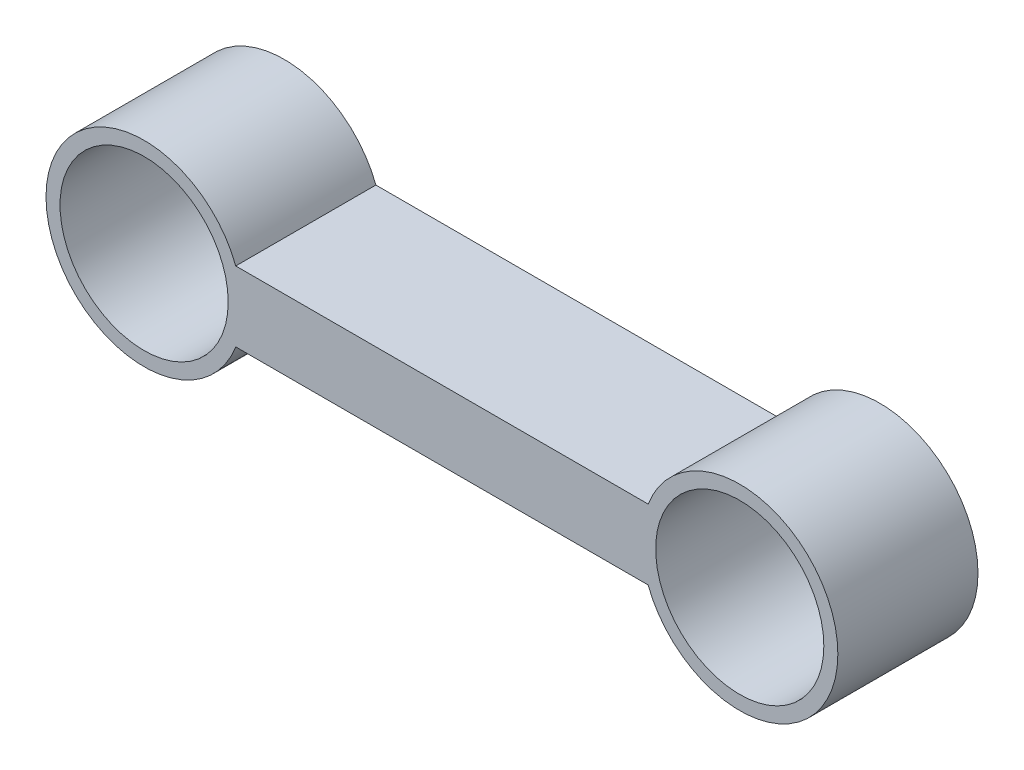
ISO-10303-21;
HEADER;
FILE_DESCRIPTION(('STEP AP214'),'2;1');
FILE_NAME('part.step','',(''),(''),'','','');
FILE_SCHEMA(('AUTOMOTIVE_DESIGN { 1 0 10303 214 1 1 1 1 }'));
ENDSEC;
DATA;
#1=APPLICATION_CONTEXT('core data for automotive mechanical design processes');
#2=APPLICATION_PROTOCOL_DEFINITION('international standard','automotive_design',2000,#1);
#3=PRODUCT_CONTEXT('',#1,'mechanical');
#4=PRODUCT('Part','Part','',(#3));
#5=PRODUCT_RELATED_PRODUCT_CATEGORY('part','',(#4));
#6=PRODUCT_DEFINITION_FORMATION('','',#4);
#7=PRODUCT_DEFINITION_CONTEXT('part definition',#1,'design');
#8=PRODUCT_DEFINITION('design','',#6,#7);
#9=PRODUCT_DEFINITION_SHAPE('','',#8);
#10=(LENGTH_UNIT() NAMED_UNIT(*) SI_UNIT(.MILLI.,.METRE.));
#11=(NAMED_UNIT(*) PLANE_ANGLE_UNIT() SI_UNIT($,.RADIAN.));
#12=(NAMED_UNIT(*) SI_UNIT($,.STERADIAN.) SOLID_ANGLE_UNIT());
#13=UNCERTAINTY_MEASURE_WITH_UNIT(LENGTH_MEASURE(1.E-05),#10,'distance_accuracy_value','');
#14=(GEOMETRIC_REPRESENTATION_CONTEXT(3) GLOBAL_UNCERTAINTY_ASSIGNED_CONTEXT((#13)) GLOBAL_UNIT_ASSIGNED_CONTEXT((#10,
#11,#12)) REPRESENTATION_CONTEXT('',''));
#15=CARTESIAN_POINT('',(0.,0.,0.));
#16=DIRECTION('',(0.,0.,1.));
#17=DIRECTION('',(1.,0.,0.));
#18=AXIS2_PLACEMENT_3D('',#15,#16,#17);
#19=CARTESIAN_POINT('',(0.,0.,25.4));
#20=DIRECTION('',(0.,0.,-1.));
#21=DIRECTION('',(-1.,0.,0.));
#22=AXIS2_PLACEMENT_3D('',#19,#20,#21);
#23=CYLINDRICAL_SURFACE('',#22,17.78);
#24=CARTESIAN_POINT('',(0.,0.,0.));
#25=DIRECTION('',(0.,0.,1.));
#26=DIRECTION('',(1.,0.,0.));
#27=AXIS2_PLACEMENT_3D('',#24,#25,#26);
#28=CIRCLE('',#27,17.78);
#29=CARTESIAN_POINT('',(16.60740497489,6.35,0.));
#30=VERTEX_POINT('',#29);
#31=CARTESIAN_POINT('',(16.60740497489,-6.35,0.));
#32=VERTEX_POINT('',#31);
#33=EDGE_CURVE('E108',#30,#32,#28,.T.);
#34=ORIENTED_EDGE('',*,*,#33,.T.);
#35=DIRECTION('',(0.,0.,-1.));
#36=VECTOR('',#35,1.);
#37=CARTESIAN_POINT('',(16.60740497489,-6.35,25.4));
#38=LINE('',#37,#36);
#39=CARTESIAN_POINT('',(16.60740497489,-6.35,25.4));
#40=VERTEX_POINT('',#39);
#41=EDGE_CURVE('E11',#40,#32,#38,.T.);
#42=ORIENTED_EDGE('',*,*,#41,.F.);
#43=CARTESIAN_POINT('',(0.,0.,25.4));
#44=DIRECTION('',(0.,0.,1.));
#45=DIRECTION('',(1.,0.,0.));
#46=AXIS2_PLACEMENT_3D('',#43,#44,#45);
#47=CIRCLE('',#46,17.78);
#48=CARTESIAN_POINT('',(16.60740497489,6.35,25.4));
#49=VERTEX_POINT('',#48);
#50=EDGE_CURVE('E78',#49,#40,#47,.T.);
#51=ORIENTED_EDGE('',*,*,#50,.F.);
#52=DIRECTION('',(0.,0.,-1.));
#53=VECTOR('',#52,1.);
#54=CARTESIAN_POINT('',(16.60740497489,6.35,25.4));
#55=LINE('',#54,#53);
#56=EDGE_CURVE('E104',#49,#30,#55,.T.);
#57=ORIENTED_EDGE('',*,*,#56,.T.);
#58=EDGE_LOOP('',(#34,#42,#51,#57));
#59=FACE_BOUND('',#58,.T.);
#60=ADVANCED_FACE('F35',(#59),#23,.T.);
#61=CARTESIAN_POINT('',(0.,-6.35,25.4));
#62=DIRECTION('',(0.,-1.,0.));
#63=DIRECTION('',(0.,0.,-1.));
#64=AXIS2_PLACEMENT_3D('',#61,#62,#63);
#65=PLANE('',#64);
#66=DIRECTION('',(-1.,0.,0.));
#67=VECTOR('',#66,1.);
#68=CARTESIAN_POINT('',(0.,-6.35,0.));
#69=LINE('',#68,#67);
#70=CARTESIAN_POINT('',(91.34259502511,-6.35,0.));
#71=VERTEX_POINT('',#70);
#72=EDGE_CURVE('E88',#71,#32,#69,.T.);
#73=ORIENTED_EDGE('',*,*,#72,.F.);
#74=DIRECTION('',(0.,0.,-1.));
#75=VECTOR('',#74,1.);
#76=CARTESIAN_POINT('',(91.34259502511,-6.35,25.4));
#77=LINE('',#76,#75);
#78=CARTESIAN_POINT('',(91.34259502511,-6.35,25.4));
#79=VERTEX_POINT('',#78);
#80=EDGE_CURVE('E44',#79,#71,#77,.T.);
#81=ORIENTED_EDGE('',*,*,#80,.F.);
#82=DIRECTION('',(-1.,0.,0.));
#83=VECTOR('',#82,1.);
#84=CARTESIAN_POINT('',(0.,-6.35,25.4));
#85=LINE('',#84,#83);
#86=EDGE_CURVE('E86',#79,#40,#85,.T.);
#87=ORIENTED_EDGE('',*,*,#86,.T.);
#88=ORIENTED_EDGE('',*,*,#41,.T.);
#89=EDGE_LOOP('',(#73,#81,#87,#88));
#90=FACE_BOUND('',#89,.T.);
#91=ADVANCED_FACE('F85',(#90),#65,.T.);
#92=CARTESIAN_POINT('',(107.95,0.,25.4));
#93=DIRECTION('',(0.,0.,-1.));
#94=DIRECTION('',(-1.,0.,0.));
#95=AXIS2_PLACEMENT_3D('',#92,#93,#94);
#96=CYLINDRICAL_SURFACE('',#95,17.78);
#97=CARTESIAN_POINT('',(107.95,0.,0.));
#98=DIRECTION('',(0.,0.,1.));
#99=DIRECTION('',(1.,0.,0.));
#100=AXIS2_PLACEMENT_3D('',#97,#98,#99);
#101=CIRCLE('',#100,17.78);
#102=CARTESIAN_POINT('',(91.34259502511,6.35,0.));
#103=VERTEX_POINT('',#102);
#104=EDGE_CURVE('E67',#71,#103,#101,.T.);
#105=ORIENTED_EDGE('',*,*,#104,.T.);
#106=DIRECTION('',(0.,0.,-1.));
#107=VECTOR('',#106,1.);
#108=CARTESIAN_POINT('',(91.34259502511,6.35,25.4));
#109=LINE('',#108,#107);
#110=CARTESIAN_POINT('',(91.34259502511,6.35,25.4));
#111=VERTEX_POINT('',#110);
#112=EDGE_CURVE('E89',#111,#103,#109,.T.);
#113=ORIENTED_EDGE('',*,*,#112,.F.);
#114=CARTESIAN_POINT('',(107.95,0.,25.4));
#115=DIRECTION('',(0.,0.,1.));
#116=DIRECTION('',(1.,0.,0.));
#117=AXIS2_PLACEMENT_3D('',#114,#115,#116);
#118=CIRCLE('',#117,17.78);
#119=EDGE_CURVE('E90',#79,#111,#118,.T.);
#120=ORIENTED_EDGE('',*,*,#119,.F.);
#121=ORIENTED_EDGE('',*,*,#80,.T.);
#122=EDGE_LOOP('',(#105,#113,#120,#121));
#123=FACE_BOUND('',#122,.T.);
#124=ADVANCED_FACE('F91',(#123),#96,.T.);
#125=CARTESIAN_POINT('',(0.,6.35,25.4));
#126=DIRECTION('',(0.,-1.,0.));
#127=DIRECTION('',(0.,0.,-1.));
#128=AXIS2_PLACEMENT_3D('',#125,#126,#127);
#129=PLANE('',#128);
#130=DIRECTION('',(-1.,0.,0.));
#131=VECTOR('',#130,1.);
#132=CARTESIAN_POINT('',(0.,6.35,0.));
#133=LINE('',#132,#131);
#134=EDGE_CURVE('E73',#103,#30,#133,.T.);
#135=ORIENTED_EDGE('',*,*,#134,.T.);
#136=ORIENTED_EDGE('',*,*,#56,.F.);
#137=DIRECTION('',(-1.,0.,0.));
#138=VECTOR('',#137,1.);
#139=CARTESIAN_POINT('',(0.,6.35,25.4));
#140=LINE('',#139,#138);
#141=EDGE_CURVE('E52',#111,#49,#140,.T.);
#142=ORIENTED_EDGE('',*,*,#141,.F.);
#143=ORIENTED_EDGE('',*,*,#112,.T.);
#144=EDGE_LOOP('',(#135,#136,#142,#143));
#145=FACE_BOUND('',#144,.T.);
#146=ADVANCED_FACE('F118',(#145),#129,.F.);
#147=CARTESIAN_POINT('',(0.,0.,25.4));
#148=DIRECTION('',(0.,0.,-1.));
#149=DIRECTION('',(-1.,0.,0.));
#150=AXIS2_PLACEMENT_3D('',#147,#148,#149);
#151=CYLINDRICAL_SURFACE('',#150,15.24);
#152=CARTESIAN_POINT('',(0.,0.,25.4));
#153=DIRECTION('',(0.,0.,1.));
#154=DIRECTION('',(1.,0.,0.));
#155=AXIS2_PLACEMENT_3D('',#152,#153,#154);
#156=CIRCLE('',#155,15.24);
#157=CARTESIAN_POINT('',(15.24,0.,25.4));
#158=VERTEX_POINT('',#157);
#159=EDGE_CURVE('E96',#158,#158,#156,.T.);
#160=ORIENTED_EDGE('',*,*,#159,.T.);
#161=EDGE_LOOP('',(#160));
#162=FACE_BOUND('',#161,.T.);
#163=CARTESIAN_POINT('',(0.,0.,0.));
#164=DIRECTION('',(0.,0.,1.));
#165=DIRECTION('',(1.,0.,0.));
#166=AXIS2_PLACEMENT_3D('',#163,#164,#165);
#167=CIRCLE('',#166,15.24);
#168=CARTESIAN_POINT('',(15.24,0.,0.));
#169=VERTEX_POINT('',#168);
#170=EDGE_CURVE('E105',#169,#169,#167,.T.);
#171=ORIENTED_EDGE('',*,*,#170,.F.);
#172=EDGE_LOOP('',(#171));
#173=FACE_BOUND('',#172,.T.);
#174=ADVANCED_FACE('F37',(#162,#173),#151,.F.);
#175=CARTESIAN_POINT('',(107.95,0.,25.4));
#176=DIRECTION('',(0.,0.,-1.));
#177=DIRECTION('',(-1.,0.,0.));
#178=AXIS2_PLACEMENT_3D('',#175,#176,#177);
#179=CYLINDRICAL_SURFACE('',#178,15.24);
#180=CARTESIAN_POINT('',(107.95,0.,25.4));
#181=DIRECTION('',(0.,0.,1.));
#182=DIRECTION('',(1.,0.,0.));
#183=AXIS2_PLACEMENT_3D('',#180,#181,#182);
#184=CIRCLE('',#183,15.24);
#185=CARTESIAN_POINT('',(123.19,0.,25.4));
#186=VERTEX_POINT('',#185);
#187=EDGE_CURVE('E101',#186,#186,#184,.T.);
#188=ORIENTED_EDGE('',*,*,#187,.T.);
#189=EDGE_LOOP('',(#188));
#190=FACE_BOUND('',#189,.T.);
#191=CARTESIAN_POINT('',(107.95,0.,0.));
#192=DIRECTION('',(0.,0.,1.));
#193=DIRECTION('',(1.,0.,0.));
#194=AXIS2_PLACEMENT_3D('',#191,#192,#193);
#195=CIRCLE('',#194,15.24);
#196=CARTESIAN_POINT('',(123.19,0.,0.));
#197=VERTEX_POINT('',#196);
#198=EDGE_CURVE('E114',#197,#197,#195,.T.);
#199=ORIENTED_EDGE('',*,*,#198,.F.);
#200=EDGE_LOOP('',(#199));
#201=FACE_BOUND('',#200,.T.);
#202=ADVANCED_FACE('F134',(#190,#201),#179,.F.);
#203=CARTESIAN_POINT('',(0.,0.,25.4));
#204=DIRECTION('',(0.,0.,1.));
#205=DIRECTION('',(1.,0.,0.));
#206=AXIS2_PLACEMENT_3D('',#203,#204,#205);
#207=PLANE('',#206);
#208=ORIENTED_EDGE('',*,*,#159,.F.);
#209=EDGE_LOOP('',(#208));
#210=FACE_BOUND('',#209,.T.);
#211=ORIENTED_EDGE('',*,*,#50,.T.);
#212=ORIENTED_EDGE('',*,*,#86,.F.);
#213=ORIENTED_EDGE('',*,*,#119,.T.);
#214=ORIENTED_EDGE('',*,*,#141,.T.);
#215=EDGE_LOOP('',(#211,#212,#213,#214));
#216=FACE_BOUND('',#215,.T.);
#217=ORIENTED_EDGE('',*,*,#187,.F.);
#218=EDGE_LOOP('',(#217));
#219=FACE_BOUND('',#218,.T.);
#220=ADVANCED_FACE('F93',(#210,#216,#219),#207,.T.);
#221=CARTESIAN_POINT('',(0.,0.,0.));
#222=DIRECTION('',(0.,0.,1.));
#223=DIRECTION('',(1.,0.,0.));
#224=AXIS2_PLACEMENT_3D('',#221,#222,#223);
#225=PLANE('',#224);
#226=ORIENTED_EDGE('',*,*,#170,.T.);
#227=EDGE_LOOP('',(#226));
#228=FACE_BOUND('',#227,.T.);
#229=ORIENTED_EDGE('',*,*,#33,.F.);
#230=ORIENTED_EDGE('',*,*,#134,.F.);
#231=ORIENTED_EDGE('',*,*,#104,.F.);
#232=ORIENTED_EDGE('',*,*,#72,.T.);
#233=EDGE_LOOP('',(#229,#230,#231,#232));
#234=FACE_BOUND('',#233,.T.);
#235=ORIENTED_EDGE('',*,*,#198,.T.);
#236=EDGE_LOOP('',(#235));
#237=FACE_BOUND('',#236,.T.);
#238=ADVANCED_FACE('F121',(#228,#234,#237),#225,.F.);
#239=CLOSED_SHELL('',(#60,#91,#124,#146,#174,#202,#220,#238));
#240=MANIFOLD_SOLID_BREP('B2',#239);
#241=ADVANCED_BREP_SHAPE_REPRESENTATION('',(#18,#240),#14);
#242=SHAPE_DEFINITION_REPRESENTATION(#9,#241);
ENDSEC;
END-ISO-10303-21;
